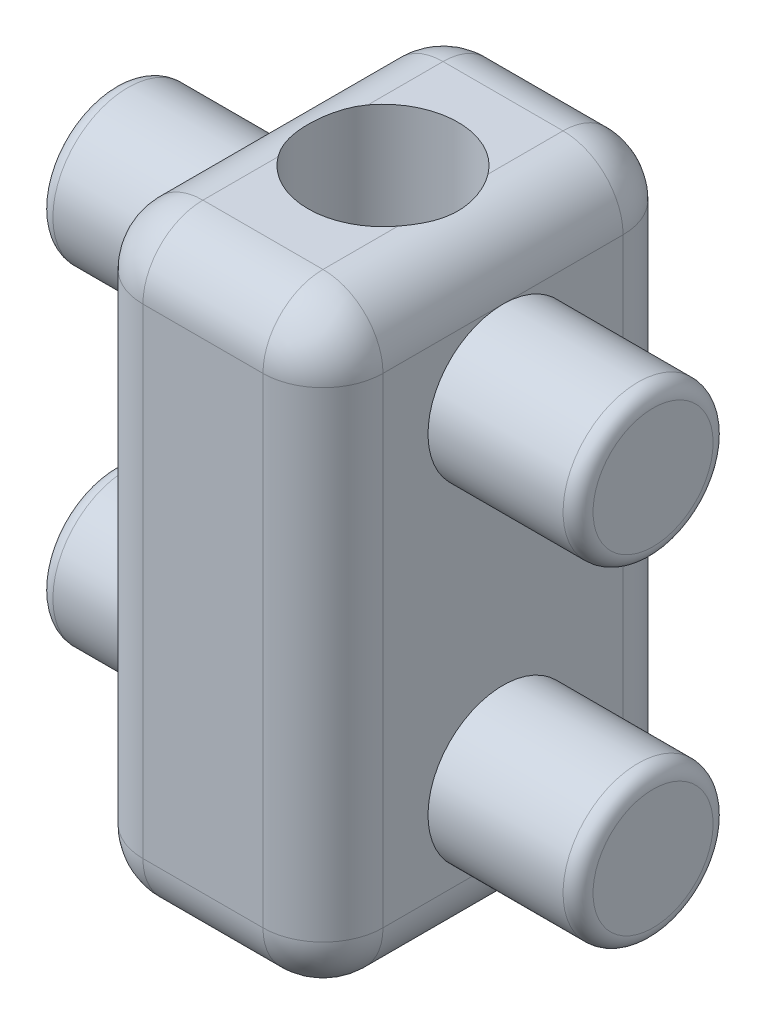
ISO-10303-21;
HEADER;
FILE_DESCRIPTION(('STEP AP214'),'2;1');
FILE_NAME('part.step','',(''),(''),'','','');
FILE_SCHEMA(('AUTOMOTIVE_DESIGN { 1 0 10303 214 1 1 1 1 }'));
ENDSEC;
DATA;
#1=APPLICATION_CONTEXT('core data for automotive mechanical design processes');
#2=APPLICATION_PROTOCOL_DEFINITION('international standard','automotive_design',2000,#1);
#3=PRODUCT_CONTEXT('',#1,'mechanical');
#4=PRODUCT('Part','Part','',(#3));
#5=PRODUCT_RELATED_PRODUCT_CATEGORY('part','',(#4));
#6=PRODUCT_DEFINITION_FORMATION('','',#4);
#7=PRODUCT_DEFINITION_CONTEXT('part definition',#1,'design');
#8=PRODUCT_DEFINITION('design','',#6,#7);
#9=PRODUCT_DEFINITION_SHAPE('','',#8);
#10=(LENGTH_UNIT() NAMED_UNIT(*) SI_UNIT(.MILLI.,.METRE.));
#11=(NAMED_UNIT(*) PLANE_ANGLE_UNIT() SI_UNIT($,.RADIAN.));
#12=(NAMED_UNIT(*) SI_UNIT($,.STERADIAN.) SOLID_ANGLE_UNIT());
#13=UNCERTAINTY_MEASURE_WITH_UNIT(LENGTH_MEASURE(1.E-05),#10,'distance_accuracy_value','');
#14=(GEOMETRIC_REPRESENTATION_CONTEXT(3) GLOBAL_UNCERTAINTY_ASSIGNED_CONTEXT((#13)) GLOBAL_UNIT_ASSIGNED_CONTEXT((#10,
#11,#12)) REPRESENTATION_CONTEXT('',''));
#15=CARTESIAN_POINT('',(0.,0.,0.));
#16=DIRECTION('',(0.,0.,1.));
#17=DIRECTION('',(1.,0.,0.));
#18=AXIS2_PLACEMENT_3D('',#15,#16,#17);
#19=CARTESIAN_POINT('',(-11.43,12.7,-12.7));
#20=DIRECTION('',(0.,-1.,0.));
#21=DIRECTION('',(0.,0.,-1.));
#22=AXIS2_PLACEMENT_3D('',#19,#20,#21);
#23=PLANE('',#22);
#24=DIRECTION('',(0.,0.,1.));
#25=VECTOR('',#24,1.);
#26=CARTESIAN_POINT('',(2.54,12.7,7.62));
#27=LINE('',#26,#25);
#28=CARTESIAN_POINT('',(2.54,12.7,5.08));
#29=VERTEX_POINT('',#28);
#30=CARTESIAN_POINT('',(2.54,12.7,1.905));
#31=VERTEX_POINT('',#30);
#32=EDGE_CURVE('E156',#29,#31,#27,.F.);
#33=ORIENTED_EDGE('',*,*,#32,.T.);
#34=CARTESIAN_POINT('',(0.,12.7,0.));
#35=DIRECTION('',(0.,-1.,0.));
#36=DIRECTION('',(0.,0.,-1.));
#37=AXIS2_PLACEMENT_3D('',#34,#35,#36);
#38=CIRCLE('',#37,3.175);
#39=CARTESIAN_POINT('',(-2.54,12.7,1.905));
#40=VERTEX_POINT('',#39);
#41=EDGE_CURVE('E11',#31,#40,#38,.T.);
#42=ORIENTED_EDGE('',*,*,#41,.T.);
#43=DIRECTION('',(0.,0.,1.));
#44=VECTOR('',#43,1.);
#45=CARTESIAN_POINT('',(-2.54,12.7,7.62));
#46=LINE('',#45,#44);
#47=CARTESIAN_POINT('',(-2.54,12.7,5.08));
#48=VERTEX_POINT('',#47);
#49=EDGE_CURVE('E172',#40,#48,#46,.T.);
#50=ORIENTED_EDGE('',*,*,#49,.T.);
#51=DIRECTION('',(-1.,0.,0.));
#52=VECTOR('',#51,1.);
#53=CARTESIAN_POINT('',(5.08,12.7,5.08));
#54=LINE('',#53,#52);
#55=EDGE_CURVE('E162',#48,#29,#54,.F.);
#56=ORIENTED_EDGE('',*,*,#55,.T.);
#57=EDGE_LOOP('',(#33,#42,#50,#56));
#58=FACE_BOUND('',#57,.T.);
#59=ADVANCED_FACE('F34',(#58),#23,.F.);
#60=CARTESIAN_POINT('',(5.08,0.,0.));
#61=DIRECTION('',(-1.,0.,0.));
#62=DIRECTION('',(0.,0.,1.));
#63=AXIS2_PLACEMENT_3D('',#60,#61,#62);
#64=PLANE('',#63);
#65=DIRECTION('',(0.,0.,-1.));
#66=VECTOR('',#65,1.);
#67=CARTESIAN_POINT('',(5.08,-10.16,0.));
#68=LINE('',#67,#66);
#69=CARTESIAN_POINT('',(5.08,-10.16,5.08));
#70=VERTEX_POINT('',#69);
#71=CARTESIAN_POINT('',(5.08,-10.16,0.));
#72=VERTEX_POINT('',#71);
#73=EDGE_CURVE('E202',#70,#72,#68,.T.);
#74=ORIENTED_EDGE('',*,*,#73,.T.);
#75=CARTESIAN_POINT('',(5.08,-6.985,0.));
#76=DIRECTION('',(1.,0.,0.));
#77=DIRECTION('',(0.,0.,-1.));
#78=AXIS2_PLACEMENT_3D('',#75,#76,#77);
#79=CIRCLE('',#78,3.175);
#80=EDGE_CURVE('E746',#72,#72,#79,.T.);
#81=ORIENTED_EDGE('',*,*,#80,.F.);
#82=CARTESIAN_POINT('',(5.08,-10.16,-5.08));
#83=VERTEX_POINT('',#82);
#84=EDGE_CURVE('E201',#72,#83,#68,.T.);
#85=ORIENTED_EDGE('',*,*,#84,.T.);
#86=DIRECTION('',(0.,1.,0.));
#87=VECTOR('',#86,1.);
#88=CARTESIAN_POINT('',(5.08,0.,-5.08));
#89=LINE('',#88,#87);
#90=CARTESIAN_POINT('',(5.08,10.16,-5.08));
#91=VERTEX_POINT('',#90);
#92=EDGE_CURVE('E195',#83,#91,#89,.T.);
#93=ORIENTED_EDGE('',*,*,#92,.T.);
#94=DIRECTION('',(0.,0.,1.));
#95=VECTOR('',#94,1.);
#96=CARTESIAN_POINT('',(5.08,10.16,0.));
#97=LINE('',#96,#95);
#98=CARTESIAN_POINT('',(5.08,10.16,0.));
#99=VERTEX_POINT('',#98);
#100=EDGE_CURVE('E198',#91,#99,#97,.T.);
#101=ORIENTED_EDGE('',*,*,#100,.T.);
#102=CARTESIAN_POINT('',(5.08,6.985,0.));
#103=DIRECTION('',(1.,0.,0.));
#104=DIRECTION('',(0.,0.,-1.));
#105=AXIS2_PLACEMENT_3D('',#102,#103,#104);
#106=CIRCLE('',#105,3.175);
#107=EDGE_CURVE('E208',#99,#99,#106,.T.);
#108=ORIENTED_EDGE('',*,*,#107,.F.);
#109=CARTESIAN_POINT('',(5.08,10.16,5.08));
#110=VERTEX_POINT('',#109);
#111=EDGE_CURVE('E197',#99,#110,#97,.T.);
#112=ORIENTED_EDGE('',*,*,#111,.T.);
#113=DIRECTION('',(0.,-1.,0.));
#114=VECTOR('',#113,1.);
#115=CARTESIAN_POINT('',(5.08,0.,5.08));
#116=LINE('',#115,#114);
#117=EDGE_CURVE('E57',#110,#70,#116,.T.);
#118=ORIENTED_EDGE('',*,*,#117,.T.);
#119=EDGE_LOOP('',(#74,#81,#85,#93,#101,#108,#112,#118));
#120=FACE_BOUND('',#119,.T.);
#121=ADVANCED_FACE('F364',(#120),#64,.F.);
#122=CARTESIAN_POINT('',(5.08,-12.7,-7.62));
#123=DIRECTION('',(0.,0.,1.));
#124=DIRECTION('',(1.,0.,0.));
#125=AXIS2_PLACEMENT_3D('',#122,#123,#124);
#126=PLANE('',#125);
#127=DIRECTION('',(-1.,0.,0.));
#128=VECTOR('',#127,1.);
#129=CARTESIAN_POINT('',(5.08,-10.16,-7.62));
#130=LINE('',#129,#128);
#131=CARTESIAN_POINT('',(2.54,-10.16,-7.62));
#132=VERTEX_POINT('',#131);
#133=CARTESIAN_POINT('',(-2.54,-10.16,-7.62));
#134=VERTEX_POINT('',#133);
#135=EDGE_CURVE('E756',#132,#134,#130,.T.);
#136=ORIENTED_EDGE('',*,*,#135,.T.);
#137=DIRECTION('',(0.,1.,0.));
#138=VECTOR('',#137,1.);
#139=CARTESIAN_POINT('',(-2.54,12.7,-7.62));
#140=LINE('',#139,#138);
#141=CARTESIAN_POINT('',(-2.54,10.16,-7.62));
#142=VERTEX_POINT('',#141);
#143=EDGE_CURVE('E759',#134,#142,#140,.T.);
#144=ORIENTED_EDGE('',*,*,#143,.T.);
#145=DIRECTION('',(-1.,0.,0.));
#146=VECTOR('',#145,1.);
#147=CARTESIAN_POINT('',(5.08,10.16,-7.62));
#148=LINE('',#147,#146);
#149=CARTESIAN_POINT('',(2.54,10.16,-7.62));
#150=VERTEX_POINT('',#149);
#151=EDGE_CURVE('E754',#142,#150,#148,.F.);
#152=ORIENTED_EDGE('',*,*,#151,.T.);
#153=DIRECTION('',(0.,1.,0.));
#154=VECTOR('',#153,1.);
#155=CARTESIAN_POINT('',(2.54,-12.7,-7.62));
#156=LINE('',#155,#154);
#157=EDGE_CURVE('E275',#150,#132,#156,.F.);
#158=ORIENTED_EDGE('',*,*,#157,.T.);
#159=EDGE_LOOP('',(#136,#144,#152,#158));
#160=FACE_BOUND('',#159,.T.);
#161=ADVANCED_FACE('F367',(#160),#126,.F.);
#162=CARTESIAN_POINT('',(5.08,-12.7,7.62));
#163=DIRECTION('',(0.,0.,-1.));
#164=DIRECTION('',(-1.,0.,0.));
#165=AXIS2_PLACEMENT_3D('',#162,#163,#164);
#166=PLANE('',#165);
#167=DIRECTION('',(-1.,0.,0.));
#168=VECTOR('',#167,1.);
#169=CARTESIAN_POINT('',(5.08,10.16,7.62));
#170=LINE('',#169,#168);
#171=CARTESIAN_POINT('',(2.54,10.16,7.62));
#172=VERTEX_POINT('',#171);
#173=CARTESIAN_POINT('',(-2.54,10.16,7.62));
#174=VERTEX_POINT('',#173);
#175=EDGE_CURVE('E180',#172,#174,#170,.T.);
#176=ORIENTED_EDGE('',*,*,#175,.T.);
#177=DIRECTION('',(0.,-1.,0.));
#178=VECTOR('',#177,1.);
#179=CARTESIAN_POINT('',(-2.54,-12.7,7.62));
#180=LINE('',#179,#178);
#181=CARTESIAN_POINT('',(-2.54,-10.16,7.62));
#182=VERTEX_POINT('',#181);
#183=EDGE_CURVE('E183',#174,#182,#180,.T.);
#184=ORIENTED_EDGE('',*,*,#183,.T.);
#185=DIRECTION('',(-1.,0.,0.));
#186=VECTOR('',#185,1.);
#187=CARTESIAN_POINT('',(5.08,-10.16,7.62));
#188=LINE('',#187,#186);
#189=CARTESIAN_POINT('',(2.54,-10.16,7.62));
#190=VERTEX_POINT('',#189);
#191=EDGE_CURVE('E178',#182,#190,#188,.F.);
#192=ORIENTED_EDGE('',*,*,#191,.T.);
#193=DIRECTION('',(0.,-1.,0.));
#194=VECTOR('',#193,1.);
#195=CARTESIAN_POINT('',(2.54,-12.7,7.62));
#196=LINE('',#195,#194);
#197=EDGE_CURVE('E176',#190,#172,#196,.F.);
#198=ORIENTED_EDGE('',*,*,#197,.T.);
#199=EDGE_LOOP('',(#176,#184,#192,#198));
#200=FACE_BOUND('',#199,.T.);
#201=ADVANCED_FACE('F376',(#200),#166,.F.);
#202=CARTESIAN_POINT('',(5.08,-12.7,7.62));
#203=DIRECTION('',(0.,1.,0.));
#204=DIRECTION('',(0.,0.,1.));
#205=AXIS2_PLACEMENT_3D('',#202,#203,#204);
#206=PLANE('',#205);
#207=DIRECTION('',(-1.,0.,0.));
#208=VECTOR('',#207,1.);
#209=CARTESIAN_POINT('',(5.08,-12.7,5.08));
#210=LINE('',#209,#208);
#211=CARTESIAN_POINT('',(2.54,-12.7,5.08));
#212=VERTEX_POINT('',#211);
#213=CARTESIAN_POINT('',(-2.54,-12.7,5.08));
#214=VERTEX_POINT('',#213);
#215=EDGE_CURVE('E763',#212,#214,#210,.T.);
#216=ORIENTED_EDGE('',*,*,#215,.T.);
#217=DIRECTION('',(0.,0.,-1.));
#218=VECTOR('',#217,1.);
#219=CARTESIAN_POINT('',(-2.54,-12.7,-7.62));
#220=LINE('',#219,#218);
#221=CARTESIAN_POINT('',(-2.54,-12.7,-5.08));
#222=VERTEX_POINT('',#221);
#223=EDGE_CURVE('E167',#214,#222,#220,.T.);
#224=ORIENTED_EDGE('',*,*,#223,.T.);
#225=DIRECTION('',(-1.,0.,0.));
#226=VECTOR('',#225,1.);
#227=CARTESIAN_POINT('',(5.08,-12.7,-5.08));
#228=LINE('',#227,#226);
#229=CARTESIAN_POINT('',(2.54,-12.7,-5.08));
#230=VERTEX_POINT('',#229);
#231=EDGE_CURVE('E764',#222,#230,#228,.F.);
#232=ORIENTED_EDGE('',*,*,#231,.T.);
#233=DIRECTION('',(0.,0.,-1.));
#234=VECTOR('',#233,1.);
#235=CARTESIAN_POINT('',(2.54,-12.7,7.62));
#236=LINE('',#235,#234);
#237=EDGE_CURVE('E761',#230,#212,#236,.F.);
#238=ORIENTED_EDGE('',*,*,#237,.T.);
#239=EDGE_LOOP('',(#216,#224,#232,#238));
#240=FACE_BOUND('',#239,.T.);
#241=ADVANCED_FACE('F372',(#240),#206,.F.);
#242=CARTESIAN_POINT('',(-5.08,0.,0.));
#243=DIRECTION('',(-1.,0.,0.));
#244=DIRECTION('',(0.,0.,1.));
#245=AXIS2_PLACEMENT_3D('',#242,#243,#244);
#246=PLANE('',#245);
#247=DIRECTION('',(0.,0.,-1.));
#248=VECTOR('',#247,1.);
#249=CARTESIAN_POINT('',(-5.08,-10.16,7.62));
#250=LINE('',#249,#248);
#251=CARTESIAN_POINT('',(-5.08,-10.16,-5.08));
#252=VERTEX_POINT('',#251);
#253=CARTESIAN_POINT('',(-5.08,-10.16,0.));
#254=VERTEX_POINT('',#253);
#255=EDGE_CURVE('E188',#252,#254,#250,.F.);
#256=ORIENTED_EDGE('',*,*,#255,.T.);
#257=CARTESIAN_POINT('',(-5.08,-6.985,0.));
#258=DIRECTION('',(1.,0.,0.));
#259=DIRECTION('',(0.,0.,-1.));
#260=AXIS2_PLACEMENT_3D('',#257,#258,#259);
#261=CIRCLE('',#260,3.175);
#262=EDGE_CURVE('E159',#254,#254,#261,.T.);
#263=ORIENTED_EDGE('',*,*,#262,.T.);
#264=CARTESIAN_POINT('',(-5.08,-10.16,5.08));
#265=VERTEX_POINT('',#264);
#266=EDGE_CURVE('E187',#254,#265,#250,.F.);
#267=ORIENTED_EDGE('',*,*,#266,.T.);
#268=DIRECTION('',(0.,-1.,0.));
#269=VECTOR('',#268,1.);
#270=CARTESIAN_POINT('',(-5.08,12.7,5.08));
#271=LINE('',#270,#269);
#272=CARTESIAN_POINT('',(-5.08,10.16,5.08));
#273=VERTEX_POINT('',#272);
#274=EDGE_CURVE('E190',#265,#273,#271,.F.);
#275=ORIENTED_EDGE('',*,*,#274,.T.);
#276=DIRECTION('',(0.,0.,1.));
#277=VECTOR('',#276,1.);
#278=CARTESIAN_POINT('',(-5.08,10.16,-7.62));
#279=LINE('',#278,#277);
#280=CARTESIAN_POINT('',(-5.08,10.16,0.));
#281=VERTEX_POINT('',#280);
#282=EDGE_CURVE('E193',#273,#281,#279,.F.);
#283=ORIENTED_EDGE('',*,*,#282,.T.);
#284=CARTESIAN_POINT('',(-5.08,6.985,0.));
#285=DIRECTION('',(1.,0.,0.));
#286=DIRECTION('',(0.,0.,-1.));
#287=AXIS2_PLACEMENT_3D('',#284,#285,#286);
#288=CIRCLE('',#287,3.175);
#289=EDGE_CURVE('E744',#281,#281,#288,.T.);
#290=ORIENTED_EDGE('',*,*,#289,.T.);
#291=CARTESIAN_POINT('',(-5.08,10.16,-5.08));
#292=VERTEX_POINT('',#291);
#293=EDGE_CURVE('E192',#281,#292,#279,.F.);
#294=ORIENTED_EDGE('',*,*,#293,.T.);
#295=DIRECTION('',(0.,1.,0.));
#296=VECTOR('',#295,1.);
#297=CARTESIAN_POINT('',(-5.08,-12.7,-5.08));
#298=LINE('',#297,#296);
#299=EDGE_CURVE('E185',#292,#252,#298,.F.);
#300=ORIENTED_EDGE('',*,*,#299,.T.);
#301=EDGE_LOOP('',(#256,#263,#267,#275,#283,#290,#294,#300));
#302=FACE_BOUND('',#301,.T.);
#303=ADVANCED_FACE('F368',(#302),#246,.T.);
#304=CARTESIAN_POINT('',(5.08,10.16,5.08));
#305=DIRECTION('',(-1.,0.,0.));
#306=DIRECTION('',(0.,0.,1.));
#307=AXIS2_PLACEMENT_3D('',#304,#305,#306);
#308=CYLINDRICAL_SURFACE('',#307,2.54);
#309=CARTESIAN_POINT('',(2.54,10.16,5.08));
#310=DIRECTION('',(1.,0.,0.));
#311=DIRECTION('',(0.,0.,-1.));
#312=AXIS2_PLACEMENT_3D('',#309,#310,#311);
#313=CIRCLE('',#312,2.54);
#314=EDGE_CURVE('E272',#29,#172,#313,.T.);
#315=ORIENTED_EDGE('',*,*,#314,.F.);
#316=ORIENTED_EDGE('',*,*,#55,.F.);
#317=CARTESIAN_POINT('',(-2.54,10.16,5.08));
#318=DIRECTION('',(-1.,0.,0.));
#319=DIRECTION('',(0.,0.,1.));
#320=AXIS2_PLACEMENT_3D('',#317,#318,#319);
#321=CIRCLE('',#320,2.54);
#322=EDGE_CURVE('E269',#174,#48,#321,.T.);
#323=ORIENTED_EDGE('',*,*,#322,.F.);
#324=ORIENTED_EDGE('',*,*,#175,.F.);
#325=EDGE_LOOP('',(#315,#316,#323,#324));
#326=FACE_BOUND('',#325,.T.);
#327=ADVANCED_FACE('F371',(#326),#308,.T.);
#328=CARTESIAN_POINT('',(2.54,10.16,5.08));
#329=DIRECTION('',(0.,0.,1.));
#330=DIRECTION('',(1.,0.,0.));
#331=AXIS2_PLACEMENT_3D('',#328,#329,#330);
#332=SPHERICAL_SURFACE('',#331,2.54);
#333=CARTESIAN_POINT('',(2.54,10.16,5.08));
#334=DIRECTION('',(0.,0.,1.));
#335=DIRECTION('',(1.,0.,0.));
#336=AXIS2_PLACEMENT_3D('',#333,#334,#335);
#337=CIRCLE('',#336,2.54);
#338=EDGE_CURVE('E264',#29,#110,#337,.F.);
#339=ORIENTED_EDGE('',*,*,#338,.F.);
#340=ORIENTED_EDGE('',*,*,#314,.T.);
#341=CARTESIAN_POINT('',(2.54,10.16,5.08));
#342=DIRECTION('',(0.,1.,0.));
#343=DIRECTION('',(0.,0.,1.));
#344=AXIS2_PLACEMENT_3D('',#341,#342,#343);
#345=CIRCLE('',#344,2.54);
#346=EDGE_CURVE('E266',#110,#172,#345,.F.);
#347=ORIENTED_EDGE('',*,*,#346,.F.);
#348=EDGE_LOOP('',(#339,#340,#347));
#349=FACE_BOUND('',#348,.T.);
#350=ADVANCED_FACE('F468',(#349),#332,.T.);
#351=CARTESIAN_POINT('',(-2.54,10.16,5.08));
#352=DIRECTION('',(0.,0.,1.));
#353=DIRECTION('',(1.,0.,0.));
#354=AXIS2_PLACEMENT_3D('',#351,#352,#353);
#355=SPHERICAL_SURFACE('',#354,2.54);
#356=CARTESIAN_POINT('',(-2.54,10.16,5.08));
#357=DIRECTION('',(0.,1.,0.));
#358=DIRECTION('',(0.,0.,1.));
#359=AXIS2_PLACEMENT_3D('',#356,#357,#358);
#360=CIRCLE('',#359,2.54);
#361=EDGE_CURVE('E258',#174,#273,#360,.F.);
#362=ORIENTED_EDGE('',*,*,#361,.F.);
#363=ORIENTED_EDGE('',*,*,#322,.T.);
#364=CARTESIAN_POINT('',(-2.54,10.16,5.08));
#365=DIRECTION('',(0.,0.,1.));
#366=DIRECTION('',(1.,0.,0.));
#367=AXIS2_PLACEMENT_3D('',#364,#365,#366);
#368=CIRCLE('',#367,2.54);
#369=EDGE_CURVE('E261',#273,#48,#368,.F.);
#370=ORIENTED_EDGE('',*,*,#369,.F.);
#371=EDGE_LOOP('',(#362,#363,#370));
#372=FACE_BOUND('',#371,.T.);
#373=ADVANCED_FACE('F477',(#372),#355,.T.);
#374=CARTESIAN_POINT('',(2.54,0.,5.08));
#375=DIRECTION('',(0.,-1.,0.));
#376=DIRECTION('',(0.,0.,-1.));
#377=AXIS2_PLACEMENT_3D('',#374,#375,#376);
#378=CYLINDRICAL_SURFACE('',#377,2.54);
#379=ORIENTED_EDGE('',*,*,#346,.T.);
#380=ORIENTED_EDGE('',*,*,#197,.F.);
#381=CARTESIAN_POINT('',(2.54,-10.16,5.08));
#382=DIRECTION('',(0.,-1.,0.));
#383=DIRECTION('',(0.,0.,-1.));
#384=AXIS2_PLACEMENT_3D('',#381,#382,#383);
#385=CIRCLE('',#384,2.54);
#386=EDGE_CURVE('E252',#70,#190,#385,.T.);
#387=ORIENTED_EDGE('',*,*,#386,.F.);
#388=ORIENTED_EDGE('',*,*,#117,.F.);
#389=EDGE_LOOP('',(#379,#380,#387,#388));
#390=FACE_BOUND('',#389,.T.);
#391=ADVANCED_FACE('F485',(#390),#378,.T.);
#392=CARTESIAN_POINT('',(2.54,10.16,0.));
#393=DIRECTION('',(0.,0.,1.));
#394=DIRECTION('',(1.,0.,0.));
#395=AXIS2_PLACEMENT_3D('',#392,#393,#394);
#396=CYLINDRICAL_SURFACE('',#395,2.54);
#397=CARTESIAN_POINT('',(2.54,12.7,1.905));
#398=CARTESIAN_POINT('',(2.5930144747761,12.6999862252163,1.83433008024039));
#399=CARTESIAN_POINT('',(2.64304418780027,12.6983400949674,1.76146316158012));
#400=CARTESIAN_POINT('',(2.73681256754995,12.6928023717573,1.61190923242004));
#401=CARTESIAN_POINT('',(2.78055403974719,12.6889117840593,1.5352239461572));
#402=CARTESIAN_POINT('',(2.86150406932594,12.6798990340502,1.37848165114559));
#403=CARTESIAN_POINT('',(2.89870748689939,12.6747759102249,1.29842205047689));
#404=CARTESIAN_POINT('',(2.96631988606513,12.6642012790137,1.13549535037719));
#405=CARTESIAN_POINT('',(2.99672819686997,12.6587497392752,1.05262797470223));
#406=CARTESIAN_POINT('',(3.05054069604224,12.6483126113036,0.88464818978456));
#407=CARTESIAN_POINT('',(3.0739470624711,12.6433268785069,0.799536487656744));
#408=CARTESIAN_POINT('',(3.1136022125579,12.6344684587865,0.627605400580466));
#409=CARTESIAN_POINT('',(3.12985126443965,12.6305957301544,0.540786079753235));
#410=CARTESIAN_POINT('',(3.15504934782979,12.624443734051,0.366145178129403));
#411=CARTESIAN_POINT('',(3.16400731259552,12.6221625171033,0.278324957914515));
#412=CARTESIAN_POINT('',(3.17458002225839,12.6194589557401,0.102214919682188));
#413=CARTESIAN_POINT('',(3.17619487430703,12.6190365842002,0.0139251085358922));
#414=CARTESIAN_POINT('',(3.17208089299991,12.6200971385345,-0.161895069374409));
#415=CARTESIAN_POINT('',(3.16639983447211,12.6215676695157,-0.249426636477158));
#416=CARTESIAN_POINT('',(3.14782483185976,12.6262198130967,-0.423675780026822));
#417=CARTESIAN_POINT('',(3.13493069870951,12.6294014705478,-0.510393335076655));
#418=CARTESIAN_POINT('',(3.10201816982114,12.6370992435227,-0.682489232509958));
#419=CARTESIAN_POINT('',(3.08199288994507,12.6416166478083,-0.767866197293173));
#420=CARTESIAN_POINT('',(3.03496640143451,12.6514222048976,-0.936630510721468));
#421=CARTESIAN_POINT('',(3.00796532716197,12.6567103428551,-1.02001789765435));
#422=CARTESIAN_POINT('',(2.95102683913863,12.6666673723006,-1.17384523842122));
#423=CARTESIAN_POINT('',(2.92189644299456,12.6713297189628,-1.24458573482167));
#424=CARTESIAN_POINT('',(2.85859769024736,12.68014203093,-1.3837954353501));
#425=CARTESIAN_POINT('',(2.82443031366766,12.6842920956194,-1.45226507814085));
#426=CARTESIAN_POINT('',(2.75126299343156,12.6914658240478,-1.58650838612093));
#427=CARTESIAN_POINT('',(2.71227019344552,12.6944911269402,-1.65228584922509));
#428=CARTESIAN_POINT('',(2.62959767281221,12.6987548964392,-1.78092659831066));
#429=CARTESIAN_POINT('',(2.5859157945231,12.6999925366479,-1.84378852351398));
#430=CARTESIAN_POINT('',(2.54,12.7,-1.905));
#431=B_SPLINE_CURVE_WITH_KNOTS('',3,(#397,#398,#399,#400,#401,#402,#403,#404,#405,#406,#407,
#408,#409,#410,#411,#412,#413,#414,#415,#416,#417,#418,#419,#420,#421,#422,#423,#424,#425,#426,
#427,#428,#429,#430),.UNSPECIFIED.,.F.,.F.,(4,2,2,2,2,2,2,2,2,2,2,2,2,2,2,2,4),(0.,
0.26489527949035,0.529672007856606,0.794655964885841,1.05966606859315,1.32459365094662,
1.58951130416678,1.85410388168812,2.1186925982337,2.38155754601834,2.64442938421755,
2.90755567990787,3.17067690785609,3.40041930587477,3.63011706276295,3.85947874883193,
4.08894642994839),.UNSPECIFIED.);
#432=CARTESIAN_POINT('',(2.54,12.7,-1.905));
#433=VERTEX_POINT('',#432);
#434=EDGE_CURVE('E49',#31,#433,#431,.T.);
#435=ORIENTED_EDGE('',*,*,#434,.F.);
#436=ORIENTED_EDGE('',*,*,#32,.F.);
#437=ORIENTED_EDGE('',*,*,#338,.T.);
#438=ORIENTED_EDGE('',*,*,#111,.F.);
#439=ORIENTED_EDGE('',*,*,#100,.F.);
#440=CARTESIAN_POINT('',(2.54,10.16,-5.08));
#441=DIRECTION('',(0.,0.,-1.));
#442=DIRECTION('',(-1.,0.,0.));
#443=AXIS2_PLACEMENT_3D('',#440,#441,#442);
#444=CIRCLE('',#443,2.54);
#445=CARTESIAN_POINT('',(2.54,12.7,-5.08));
#446=VERTEX_POINT('',#445);
#447=EDGE_CURVE('E249',#446,#91,#444,.T.);
#448=ORIENTED_EDGE('',*,*,#447,.F.);
#449=EDGE_CURVE('E158',#433,#446,#27,.F.);
#450=ORIENTED_EDGE('',*,*,#449,.F.);
#451=EDGE_LOOP('',(#435,#436,#437,#438,#439,#448,#450));
#452=FACE_BOUND('',#451,.T.);
#453=ADVANCED_FACE('F154',(#452),#396,.T.);
#454=CARTESIAN_POINT('',(5.08,10.16,-5.08));
#455=DIRECTION('',(-1.,0.,0.));
#456=DIRECTION('',(0.,0.,1.));
#457=AXIS2_PLACEMENT_3D('',#454,#455,#456);
#458=CYLINDRICAL_SURFACE('',#457,2.54);
#459=CARTESIAN_POINT('',(-2.54,10.16,-5.08));
#460=DIRECTION('',(-1.,0.,0.));
#461=DIRECTION('',(0.,0.,1.));
#462=AXIS2_PLACEMENT_3D('',#459,#460,#461);
#463=CIRCLE('',#462,2.54);
#464=CARTESIAN_POINT('',(-2.54,12.7,-5.08));
#465=VERTEX_POINT('',#464);
#466=EDGE_CURVE('E243',#465,#142,#463,.T.);
#467=ORIENTED_EDGE('',*,*,#466,.F.);
#468=DIRECTION('',(-1.,0.,0.));
#469=VECTOR('',#468,1.);
#470=CARTESIAN_POINT('',(5.08,12.7,-5.08));
#471=LINE('',#470,#469);
#472=EDGE_CURVE('E165',#446,#465,#471,.T.);
#473=ORIENTED_EDGE('',*,*,#472,.F.);
#474=CARTESIAN_POINT('',(2.54,10.16,-5.08));
#475=DIRECTION('',(1.,0.,0.));
#476=DIRECTION('',(0.,0.,-1.));
#477=AXIS2_PLACEMENT_3D('',#474,#475,#476);
#478=CIRCLE('',#477,2.54);
#479=EDGE_CURVE('E246',#150,#446,#478,.T.);
#480=ORIENTED_EDGE('',*,*,#479,.F.);
#481=ORIENTED_EDGE('',*,*,#151,.F.);
#482=EDGE_LOOP('',(#467,#473,#480,#481));
#483=FACE_BOUND('',#482,.T.);
#484=ADVANCED_FACE('F436',(#483),#458,.T.);
#485=CARTESIAN_POINT('',(-2.54,10.16,7.62));
#486=DIRECTION('',(0.,0.,-1.));
#487=DIRECTION('',(-1.,0.,0.));
#488=AXIS2_PLACEMENT_3D('',#485,#486,#487);
#489=CYLINDRICAL_SURFACE('',#488,2.54);
#490=CARTESIAN_POINT('',(-2.54,12.7,-1.905));
#491=CARTESIAN_POINT('',(-2.5930144747761,12.6999862252163,-1.83433008024039));
#492=CARTESIAN_POINT('',(-2.64304418780027,12.6983400949674,-1.76146316158012));
#493=CARTESIAN_POINT('',(-2.73681256754995,12.6928023717573,-1.61190923242004));
#494=CARTESIAN_POINT('',(-2.78055403974719,12.6889117840593,-1.53522394615721));
#495=CARTESIAN_POINT('',(-2.86150406932594,12.6798990340502,-1.37848165114559));
#496=CARTESIAN_POINT('',(-2.89870748689939,12.6747759102249,-1.29842205047689));
#497=CARTESIAN_POINT('',(-2.96631988606513,12.6642012790137,-1.13549535037719));
#498=CARTESIAN_POINT('',(-2.99672819686997,12.6587497392752,-1.05262797470223));
#499=CARTESIAN_POINT('',(-3.05054069604224,12.6483126113036,-0.884648189784562));
#500=CARTESIAN_POINT('',(-3.0739470624711,12.6433268785069,-0.799536487656746));
#501=CARTESIAN_POINT('',(-3.1136022125579,12.6344684587865,-0.627605400580467));
#502=CARTESIAN_POINT('',(-3.12985126443965,12.6305957301544,-0.540786079753237));
#503=CARTESIAN_POINT('',(-3.15504934782979,12.624443734051,-0.366145178129405));
#504=CARTESIAN_POINT('',(-3.16400731259552,12.6221625171033,-0.278324957914517));
#505=CARTESIAN_POINT('',(-3.17458002225839,12.6194589557401,-0.10221491968219));
#506=CARTESIAN_POINT('',(-3.17619487430703,12.6190365842002,-0.0139251085358941));
#507=CARTESIAN_POINT('',(-3.17208089299991,12.6200971385345,0.161895069374407));
#508=CARTESIAN_POINT('',(-3.16639983447211,12.6215676695157,0.249426636477156));
#509=CARTESIAN_POINT('',(-3.14782483185976,12.6262198130967,0.42367578002682));
#510=CARTESIAN_POINT('',(-3.13493069870951,12.6294014705478,0.510393335076653));
#511=CARTESIAN_POINT('',(-3.10201816982114,12.6370992435227,0.682489232509956));
#512=CARTESIAN_POINT('',(-3.08199288994507,12.6416166478083,0.767866197293171));
#513=CARTESIAN_POINT('',(-3.03496640143451,12.6514222048976,0.936630510721466));
#514=CARTESIAN_POINT('',(-3.00796532716197,12.6567103428551,1.02001789765435));
#515=CARTESIAN_POINT('',(-2.95102683913863,12.6666673723006,1.17384523842122));
#516=CARTESIAN_POINT('',(-2.92189644299456,12.6713297189628,1.24458573482167));
#517=CARTESIAN_POINT('',(-2.85859769024736,12.68014203093,1.3837954353501));
#518=CARTESIAN_POINT('',(-2.82443031366766,12.6842920956194,1.45226507814085));
#519=CARTESIAN_POINT('',(-2.75126299343156,12.6914658240478,1.58650838612093));
#520=CARTESIAN_POINT('',(-2.71227019344552,12.6944911269402,1.65228584922509));
#521=CARTESIAN_POINT('',(-2.62959767281221,12.6987548964392,1.78092659831066));
#522=CARTESIAN_POINT('',(-2.5859157945231,12.6999925366479,1.84378852351398));
#523=CARTESIAN_POINT('',(-2.54,12.7,1.905));
#524=B_SPLINE_CURVE_WITH_KNOTS('',3,(#490,#491,#492,#493,#494,#495,#496,#497,#498,#499,#500,
#501,#502,#503,#504,#505,#506,#507,#508,#509,#510,#511,#512,#513,#514,#515,#516,#517,#518,#519,
#520,#521,#522,#523),.UNSPECIFIED.,.F.,.F.,(4,2,2,2,2,2,2,2,2,2,2,2,2,2,2,2,4),(0.,
0.26489527949035,0.529672007856606,0.794655964885841,1.05966606859315,1.32459365094662,
1.58951130416678,1.85410388168812,2.1186925982337,2.38155754601833,2.64442938421755,
2.90755567990787,3.17067690785609,3.40041930587477,3.63011706276295,3.85947874883193,
4.08894642994839),.UNSPECIFIED.);
#525=CARTESIAN_POINT('',(-2.54,12.7,-1.905));
#526=VERTEX_POINT('',#525);
#527=EDGE_CURVE('E147',#526,#40,#524,.T.);
#528=ORIENTED_EDGE('',*,*,#527,.F.);
#529=EDGE_CURVE('E173',#465,#526,#46,.T.);
#530=ORIENTED_EDGE('',*,*,#529,.F.);
#531=CARTESIAN_POINT('',(-2.54,10.16,-5.08));
#532=DIRECTION('',(0.,0.,-1.));
#533=DIRECTION('',(0.,1.,0.));
#534=AXIS2_PLACEMENT_3D('',#531,#532,#533);
#535=CIRCLE('',#534,2.54);
#536=EDGE_CURVE('E240',#292,#465,#535,.T.);
#537=ORIENTED_EDGE('',*,*,#536,.F.);
#538=ORIENTED_EDGE('',*,*,#293,.F.);
#539=ORIENTED_EDGE('',*,*,#282,.F.);
#540=ORIENTED_EDGE('',*,*,#369,.T.);
#541=ORIENTED_EDGE('',*,*,#49,.F.);
#542=EDGE_LOOP('',(#528,#530,#537,#538,#539,#540,#541));
#543=FACE_BOUND('',#542,.T.);
#544=ADVANCED_FACE('F304',(#543),#489,.T.);
#545=CARTESIAN_POINT('',(-2.54,-12.7,5.08));
#546=DIRECTION('',(0.,1.,0.));
#547=DIRECTION('',(0.,0.,1.));
#548=AXIS2_PLACEMENT_3D('',#545,#546,#547);
#549=CYLINDRICAL_SURFACE('',#548,2.54);
#550=ORIENTED_EDGE('',*,*,#361,.T.);
#551=ORIENTED_EDGE('',*,*,#274,.F.);
#552=CARTESIAN_POINT('',(-2.54,-10.16,5.08));
#553=DIRECTION('',(0.,-1.,0.));
#554=DIRECTION('',(0.,0.,-1.));
#555=AXIS2_PLACEMENT_3D('',#552,#553,#554);
#556=CIRCLE('',#555,2.54);
#557=EDGE_CURVE('E237',#182,#265,#556,.T.);
#558=ORIENTED_EDGE('',*,*,#557,.F.);
#559=ORIENTED_EDGE('',*,*,#183,.F.);
#560=EDGE_LOOP('',(#550,#551,#558,#559));
#561=FACE_BOUND('',#560,.T.);
#562=ADVANCED_FACE('F429',(#561),#549,.T.);
#563=CARTESIAN_POINT('',(5.08,-10.16,5.08));
#564=DIRECTION('',(-1.,0.,0.));
#565=DIRECTION('',(0.,0.,1.));
#566=AXIS2_PLACEMENT_3D('',#563,#564,#565);
#567=CYLINDRICAL_SURFACE('',#566,2.54);
#568=CARTESIAN_POINT('',(2.54,-10.16,5.08));
#569=DIRECTION('',(1.,0.,0.));
#570=DIRECTION('',(0.,0.,-1.));
#571=AXIS2_PLACEMENT_3D('',#568,#569,#570);
#572=CIRCLE('',#571,2.54);
#573=EDGE_CURVE('E255',#190,#212,#572,.T.);
#574=ORIENTED_EDGE('',*,*,#573,.F.);
#575=ORIENTED_EDGE('',*,*,#191,.F.);
#576=CARTESIAN_POINT('',(-2.54,-10.16,5.08));
#577=DIRECTION('',(-1.,0.,0.));
#578=DIRECTION('',(0.,0.,1.));
#579=AXIS2_PLACEMENT_3D('',#576,#577,#578);
#580=CIRCLE('',#579,2.54);
#581=EDGE_CURVE('E234',#214,#182,#580,.T.);
#582=ORIENTED_EDGE('',*,*,#581,.F.);
#583=ORIENTED_EDGE('',*,*,#215,.F.);
#584=EDGE_LOOP('',(#574,#575,#582,#583));
#585=FACE_BOUND('',#584,.T.);
#586=ADVANCED_FACE('F426',(#585),#567,.T.);
#587=CARTESIAN_POINT('',(2.54,-10.16,5.08));
#588=DIRECTION('',(0.,0.,1.));
#589=DIRECTION('',(1.,0.,0.));
#590=AXIS2_PLACEMENT_3D('',#587,#588,#589);
#591=SPHERICAL_SURFACE('',#590,2.54);
#592=ORIENTED_EDGE('',*,*,#386,.T.);
#593=ORIENTED_EDGE('',*,*,#573,.T.);
#594=CARTESIAN_POINT('',(2.54,-10.16,5.08));
#595=DIRECTION('',(0.,0.,1.));
#596=DIRECTION('',(1.,0.,0.));
#597=AXIS2_PLACEMENT_3D('',#594,#595,#596);
#598=CIRCLE('',#597,2.54);
#599=EDGE_CURVE('E231',#70,#212,#598,.F.);
#600=ORIENTED_EDGE('',*,*,#599,.F.);
#601=EDGE_LOOP('',(#592,#593,#600));
#602=FACE_BOUND('',#601,.T.);
#603=ADVANCED_FACE('F422',(#602),#591,.T.);
#604=CARTESIAN_POINT('',(2.54,10.16,-5.08));
#605=DIRECTION('',(0.,0.,1.));
#606=DIRECTION('',(1.,0.,0.));
#607=AXIS2_PLACEMENT_3D('',#604,#605,#606);
#608=SPHERICAL_SURFACE('',#607,2.54);
#609=ORIENTED_EDGE('',*,*,#479,.T.);
#610=ORIENTED_EDGE('',*,*,#447,.T.);
#611=CARTESIAN_POINT('',(2.54,10.16,-5.08));
#612=DIRECTION('',(0.,1.,0.));
#613=DIRECTION('',(0.,0.,1.));
#614=AXIS2_PLACEMENT_3D('',#611,#612,#613);
#615=CIRCLE('',#614,2.54);
#616=EDGE_CURVE('E228',#150,#91,#615,.F.);
#617=ORIENTED_EDGE('',*,*,#616,.F.);
#618=EDGE_LOOP('',(#609,#610,#617));
#619=FACE_BOUND('',#618,.T.);
#620=ADVANCED_FACE('F418',(#619),#608,.T.);
#621=CARTESIAN_POINT('',(-2.54,10.16,-5.08));
#622=DIRECTION('',(0.,0.,1.));
#623=DIRECTION('',(1.,0.,0.));
#624=AXIS2_PLACEMENT_3D('',#621,#622,#623);
#625=SPHERICAL_SURFACE('',#624,2.54);
#626=ORIENTED_EDGE('',*,*,#536,.T.);
#627=ORIENTED_EDGE('',*,*,#466,.T.);
#628=CARTESIAN_POINT('',(-2.54,10.16,-5.08));
#629=DIRECTION('',(0.,1.,0.));
#630=DIRECTION('',(0.,0.,1.));
#631=AXIS2_PLACEMENT_3D('',#628,#629,#630);
#632=CIRCLE('',#631,2.54);
#633=EDGE_CURVE('E225',#292,#142,#632,.F.);
#634=ORIENTED_EDGE('',*,*,#633,.F.);
#635=EDGE_LOOP('',(#626,#627,#634));
#636=FACE_BOUND('',#635,.T.);
#637=ADVANCED_FACE('F414',(#636),#625,.T.);
#638=CARTESIAN_POINT('',(-2.54,-10.16,5.08));
#639=DIRECTION('',(0.,0.,1.));
#640=DIRECTION('',(1.,0.,0.));
#641=AXIS2_PLACEMENT_3D('',#638,#639,#640);
#642=SPHERICAL_SURFACE('',#641,2.54);
#643=ORIENTED_EDGE('',*,*,#581,.T.);
#644=ORIENTED_EDGE('',*,*,#557,.T.);
#645=CARTESIAN_POINT('',(-2.54,-10.16,5.08));
#646=DIRECTION('',(0.,0.,1.));
#647=DIRECTION('',(1.,0.,0.));
#648=AXIS2_PLACEMENT_3D('',#645,#646,#647);
#649=CIRCLE('',#648,2.54);
#650=EDGE_CURVE('E222',#214,#265,#649,.F.);
#651=ORIENTED_EDGE('',*,*,#650,.F.);
#652=EDGE_LOOP('',(#643,#644,#651));
#653=FACE_BOUND('',#652,.T.);
#654=ADVANCED_FACE('F410',(#653),#642,.T.);
#655=CARTESIAN_POINT('',(2.54,-10.16,0.));
#656=DIRECTION('',(0.,0.,-1.));
#657=DIRECTION('',(-1.,0.,0.));
#658=AXIS2_PLACEMENT_3D('',#655,#656,#657);
#659=CYLINDRICAL_SURFACE('',#658,2.54);
#660=ORIENTED_EDGE('',*,*,#599,.T.);
#661=ORIENTED_EDGE('',*,*,#237,.F.);
#662=CARTESIAN_POINT('',(2.54,-10.16,-5.08));
#663=DIRECTION('',(0.,0.,-1.));
#664=DIRECTION('',(-1.,0.,0.));
#665=AXIS2_PLACEMENT_3D('',#662,#663,#664);
#666=CIRCLE('',#665,2.54);
#667=EDGE_CURVE('E219',#83,#230,#666,.T.);
#668=ORIENTED_EDGE('',*,*,#667,.F.);
#669=ORIENTED_EDGE('',*,*,#84,.F.);
#670=ORIENTED_EDGE('',*,*,#73,.F.);
#671=EDGE_LOOP('',(#660,#661,#668,#669,#670));
#672=FACE_BOUND('',#671,.T.);
#673=ADVANCED_FACE('F406',(#672),#659,.T.);
#674=CARTESIAN_POINT('',(2.54,0.,-5.08));
#675=DIRECTION('',(0.,1.,0.));
#676=DIRECTION('',(0.,0.,1.));
#677=AXIS2_PLACEMENT_3D('',#674,#675,#676);
#678=CYLINDRICAL_SURFACE('',#677,2.54);
#679=ORIENTED_EDGE('',*,*,#616,.T.);
#680=ORIENTED_EDGE('',*,*,#92,.F.);
#681=CARTESIAN_POINT('',(2.54,-10.16,-5.08));
#682=DIRECTION('',(0.,-1.,0.));
#683=DIRECTION('',(0.,0.,-1.));
#684=AXIS2_PLACEMENT_3D('',#681,#682,#683);
#685=CIRCLE('',#684,2.54);
#686=EDGE_CURVE('E216',#132,#83,#685,.T.);
#687=ORIENTED_EDGE('',*,*,#686,.F.);
#688=ORIENTED_EDGE('',*,*,#157,.F.);
#689=EDGE_LOOP('',(#679,#680,#687,#688));
#690=FACE_BOUND('',#689,.T.);
#691=ADVANCED_FACE('F402',(#690),#678,.T.);
#692=CARTESIAN_POINT('',(-2.54,-12.7,-5.08));
#693=DIRECTION('',(0.,-1.,0.));
#694=DIRECTION('',(0.,0.,-1.));
#695=AXIS2_PLACEMENT_3D('',#692,#693,#694);
#696=CYLINDRICAL_SURFACE('',#695,2.54);
#697=ORIENTED_EDGE('',*,*,#633,.T.);
#698=ORIENTED_EDGE('',*,*,#143,.F.);
#699=CARTESIAN_POINT('',(-2.54,-10.16,-5.08));
#700=DIRECTION('',(0.,-1.,0.));
#701=DIRECTION('',(0.,0.,-1.));
#702=AXIS2_PLACEMENT_3D('',#699,#700,#701);
#703=CIRCLE('',#702,2.54);
#704=EDGE_CURVE('E213',#252,#134,#703,.T.);
#705=ORIENTED_EDGE('',*,*,#704,.F.);
#706=ORIENTED_EDGE('',*,*,#299,.F.);
#707=EDGE_LOOP('',(#697,#698,#705,#706));
#708=FACE_BOUND('',#707,.T.);
#709=ADVANCED_FACE('F398',(#708),#696,.T.);
#710=CARTESIAN_POINT('',(-2.54,-10.16,7.62));
#711=DIRECTION('',(0.,0.,1.));
#712=DIRECTION('',(1.,0.,0.));
#713=AXIS2_PLACEMENT_3D('',#710,#711,#712);
#714=CYLINDRICAL_SURFACE('',#713,2.54);
#715=ORIENTED_EDGE('',*,*,#650,.T.);
#716=ORIENTED_EDGE('',*,*,#266,.F.);
#717=ORIENTED_EDGE('',*,*,#255,.F.);
#718=CARTESIAN_POINT('',(-2.54,-10.16,-5.08));
#719=DIRECTION('',(0.,0.,-1.));
#720=DIRECTION('',(-1.,0.,0.));
#721=AXIS2_PLACEMENT_3D('',#718,#719,#720);
#722=CIRCLE('',#721,2.54);
#723=EDGE_CURVE('E210',#222,#252,#722,.T.);
#724=ORIENTED_EDGE('',*,*,#723,.F.);
#725=ORIENTED_EDGE('',*,*,#223,.F.);
#726=EDGE_LOOP('',(#715,#716,#717,#724,#725));
#727=FACE_BOUND('',#726,.T.);
#728=ADVANCED_FACE('F394',(#727),#714,.T.);
#729=CARTESIAN_POINT('',(2.54,-10.16,-5.08));
#730=DIRECTION('',(0.,0.,1.));
#731=DIRECTION('',(1.,0.,0.));
#732=AXIS2_PLACEMENT_3D('',#729,#730,#731);
#733=SPHERICAL_SURFACE('',#732,2.54);
#734=ORIENTED_EDGE('',*,*,#686,.T.);
#735=ORIENTED_EDGE('',*,*,#667,.T.);
#736=CARTESIAN_POINT('',(2.54,-10.16,-5.08));
#737=DIRECTION('',(1.,0.,0.));
#738=DIRECTION('',(0.,0.,-1.));
#739=AXIS2_PLACEMENT_3D('',#736,#737,#738);
#740=CIRCLE('',#739,2.54);
#741=EDGE_CURVE('E207',#132,#230,#740,.F.);
#742=ORIENTED_EDGE('',*,*,#741,.F.);
#743=EDGE_LOOP('',(#734,#735,#742));
#744=FACE_BOUND('',#743,.T.);
#745=ADVANCED_FACE('F390',(#744),#733,.T.);
#746=CARTESIAN_POINT('',(-2.54,-10.16,-5.08));
#747=DIRECTION('',(0.,0.,1.));
#748=DIRECTION('',(1.,0.,0.));
#749=AXIS2_PLACEMENT_3D('',#746,#747,#748);
#750=SPHERICAL_SURFACE('',#749,2.54);
#751=ORIENTED_EDGE('',*,*,#723,.T.);
#752=ORIENTED_EDGE('',*,*,#704,.T.);
#753=CARTESIAN_POINT('',(-2.54,-10.16,-5.08));
#754=DIRECTION('',(-1.,0.,0.));
#755=DIRECTION('',(0.,0.,1.));
#756=AXIS2_PLACEMENT_3D('',#753,#754,#755);
#757=CIRCLE('',#756,2.54);
#758=EDGE_CURVE('E205',#222,#134,#757,.F.);
#759=ORIENTED_EDGE('',*,*,#758,.F.);
#760=EDGE_LOOP('',(#751,#752,#759));
#761=FACE_BOUND('',#760,.T.);
#762=ADVANCED_FACE('F386',(#761),#750,.T.);
#763=CARTESIAN_POINT('',(5.08,-10.16,-5.08));
#764=DIRECTION('',(-1.,0.,0.));
#765=DIRECTION('',(0.,0.,1.));
#766=AXIS2_PLACEMENT_3D('',#763,#764,#765);
#767=CYLINDRICAL_SURFACE('',#766,2.54);
#768=ORIENTED_EDGE('',*,*,#741,.T.);
#769=ORIENTED_EDGE('',*,*,#231,.F.);
#770=ORIENTED_EDGE('',*,*,#758,.T.);
#771=ORIENTED_EDGE('',*,*,#135,.F.);
#772=EDGE_LOOP('',(#768,#769,#770,#771));
#773=FACE_BOUND('',#772,.T.);
#774=ADVANCED_FACE('F363',(#773),#767,.T.);
#775=CARTESIAN_POINT('',(11.43,6.985,0.));
#776=DIRECTION('',(-1.,0.,0.));
#777=DIRECTION('',(0.,0.,1.));
#778=AXIS2_PLACEMENT_3D('',#775,#776,#777);
#779=CYLINDRICAL_SURFACE('',#778,3.175);
#780=CARTESIAN_POINT('',(10.795,6.985,0.));
#781=DIRECTION('',(1.,0.,0.));
#782=DIRECTION('',(0.,0.,-1.));
#783=AXIS2_PLACEMENT_3D('',#780,#781,#782);
#784=CIRCLE('',#783,3.175);
#785=CARTESIAN_POINT('',(10.795,6.985,-3.175));
#786=VERTEX_POINT('',#785);
#787=EDGE_CURVE('E295',#786,#786,#784,.F.);
#788=ORIENTED_EDGE('',*,*,#787,.T.);
#789=EDGE_LOOP('',(#788));
#790=FACE_BOUND('',#789,.T.);
#791=ORIENTED_EDGE('',*,*,#107,.T.);
#792=EDGE_LOOP('',(#791));
#793=FACE_BOUND('',#792,.T.);
#794=ADVANCED_FACE('F359',(#790,#793),#779,.T.);
#795=CARTESIAN_POINT('',(11.43,6.985,0.));
#796=DIRECTION('',(1.,0.,0.));
#797=DIRECTION('',(0.,0.,-1.));
#798=AXIS2_PLACEMENT_3D('',#795,#796,#797);
#799=PLANE('',#798);
#800=CARTESIAN_POINT('',(11.43,6.985,0.));
#801=DIRECTION('',(1.,0.,0.));
#802=DIRECTION('',(0.,0.,-1.));
#803=AXIS2_PLACEMENT_3D('',#800,#801,#802);
#804=CIRCLE('',#803,2.54);
#805=CARTESIAN_POINT('',(11.43,6.985,-2.54));
#806=VERTEX_POINT('',#805);
#807=EDGE_CURVE('E293',#806,#806,#804,.T.);
#808=ORIENTED_EDGE('',*,*,#807,.T.);
#809=EDGE_LOOP('',(#808));
#810=FACE_BOUND('',#809,.T.);
#811=ADVANCED_FACE('F355',(#810),#799,.T.);
#812=CARTESIAN_POINT('',(11.43,-6.985,0.));
#813=DIRECTION('',(-1.,0.,0.));
#814=DIRECTION('',(0.,0.,1.));
#815=AXIS2_PLACEMENT_3D('',#812,#813,#814);
#816=CYLINDRICAL_SURFACE('',#815,3.175);
#817=CARTESIAN_POINT('',(10.795,-6.985,0.));
#818=DIRECTION('',(1.,0.,0.));
#819=DIRECTION('',(0.,0.,-1.));
#820=AXIS2_PLACEMENT_3D('',#817,#818,#819);
#821=CIRCLE('',#820,3.175);
#822=CARTESIAN_POINT('',(10.795,-6.985,-3.175));
#823=VERTEX_POINT('',#822);
#824=EDGE_CURVE('E290',#823,#823,#821,.F.);
#825=ORIENTED_EDGE('',*,*,#824,.T.);
#826=EDGE_LOOP('',(#825));
#827=FACE_BOUND('',#826,.T.);
#828=ORIENTED_EDGE('',*,*,#80,.T.);
#829=EDGE_LOOP('',(#828));
#830=FACE_BOUND('',#829,.T.);
#831=ADVANCED_FACE('F351',(#827,#830),#816,.T.);
#832=CARTESIAN_POINT('',(11.43,-6.985,0.));
#833=DIRECTION('',(1.,0.,0.));
#834=DIRECTION('',(0.,0.,-1.));
#835=AXIS2_PLACEMENT_3D('',#832,#833,#834);
#836=PLANE('',#835);
#837=CARTESIAN_POINT('',(11.43,-6.985,0.));
#838=DIRECTION('',(1.,0.,0.));
#839=DIRECTION('',(0.,0.,-1.));
#840=AXIS2_PLACEMENT_3D('',#837,#838,#839);
#841=CIRCLE('',#840,2.54);
#842=CARTESIAN_POINT('',(11.43,-6.985,-2.54));
#843=VERTEX_POINT('',#842);
#844=EDGE_CURVE('E287',#843,#843,#841,.T.);
#845=ORIENTED_EDGE('',*,*,#844,.T.);
#846=EDGE_LOOP('',(#845));
#847=FACE_BOUND('',#846,.T.);
#848=ADVANCED_FACE('F347',(#847),#836,.T.);
#849=CARTESIAN_POINT('',(-11.43,6.985,0.));
#850=DIRECTION('',(1.,0.,0.));
#851=DIRECTION('',(0.,0.,-1.));
#852=AXIS2_PLACEMENT_3D('',#849,#850,#851);
#853=CYLINDRICAL_SURFACE('',#852,3.175);
#854=CARTESIAN_POINT('',(-10.795,6.985,0.));
#855=DIRECTION('',(-1.,0.,0.));
#856=DIRECTION('',(0.,0.,1.));
#857=AXIS2_PLACEMENT_3D('',#854,#855,#856);
#858=CIRCLE('',#857,3.175);
#859=CARTESIAN_POINT('',(-10.795,6.985,3.175));
#860=VERTEX_POINT('',#859);
#861=EDGE_CURVE('E281',#860,#860,#858,.F.);
#862=ORIENTED_EDGE('',*,*,#861,.T.);
#863=EDGE_LOOP('',(#862));
#864=FACE_BOUND('',#863,.T.);
#865=ORIENTED_EDGE('',*,*,#289,.F.);
#866=EDGE_LOOP('',(#865));
#867=FACE_BOUND('',#866,.T.);
#868=ADVANCED_FACE('F343',(#864,#867),#853,.T.);
#869=CARTESIAN_POINT('',(-11.43,6.985,0.));
#870=DIRECTION('',(-1.,0.,0.));
#871=DIRECTION('',(0.,0.,-1.));
#872=AXIS2_PLACEMENT_3D('',#869,#870,#871);
#873=PLANE('',#872);
#874=CARTESIAN_POINT('',(-11.43,6.985,0.));
#875=DIRECTION('',(-1.,0.,0.));
#876=DIRECTION('',(0.,0.,1.));
#877=AXIS2_PLACEMENT_3D('',#874,#875,#876);
#878=CIRCLE('',#877,2.54);
#879=CARTESIAN_POINT('',(-11.43,6.985,2.54));
#880=VERTEX_POINT('',#879);
#881=EDGE_CURVE('E284',#880,#880,#878,.T.);
#882=ORIENTED_EDGE('',*,*,#881,.T.);
#883=EDGE_LOOP('',(#882));
#884=FACE_BOUND('',#883,.T.);
#885=ADVANCED_FACE('F339',(#884),#873,.T.);
#886=CARTESIAN_POINT('',(-11.43,-6.985,0.));
#887=DIRECTION('',(1.,0.,0.));
#888=DIRECTION('',(0.,0.,-1.));
#889=AXIS2_PLACEMENT_3D('',#886,#887,#888);
#890=CYLINDRICAL_SURFACE('',#889,3.175);
#891=CARTESIAN_POINT('',(-10.795,-6.985,0.));
#892=DIRECTION('',(-1.,0.,0.));
#893=DIRECTION('',(0.,0.,1.));
#894=AXIS2_PLACEMENT_3D('',#891,#892,#893);
#895=CIRCLE('',#894,3.175);
#896=CARTESIAN_POINT('',(-10.795,-6.985,3.175));
#897=VERTEX_POINT('',#896);
#898=EDGE_CURVE('E204',#897,#897,#895,.F.);
#899=ORIENTED_EDGE('',*,*,#898,.T.);
#900=EDGE_LOOP('',(#899));
#901=FACE_BOUND('',#900,.T.);
#902=ORIENTED_EDGE('',*,*,#262,.F.);
#903=EDGE_LOOP('',(#902));
#904=FACE_BOUND('',#903,.T.);
#905=ADVANCED_FACE('F335',(#901,#904),#890,.T.);
#906=CARTESIAN_POINT('',(-11.43,-6.985,0.));
#907=DIRECTION('',(-1.,0.,0.));
#908=DIRECTION('',(0.,0.,-1.));
#909=AXIS2_PLACEMENT_3D('',#906,#907,#908);
#910=PLANE('',#909);
#911=CARTESIAN_POINT('',(-11.43,-6.985,0.));
#912=DIRECTION('',(-1.,0.,0.));
#913=DIRECTION('',(0.,0.,1.));
#914=AXIS2_PLACEMENT_3D('',#911,#912,#913);
#915=CIRCLE('',#914,2.54);
#916=CARTESIAN_POINT('',(-11.43,-6.985,2.54));
#917=VERTEX_POINT('',#916);
#918=EDGE_CURVE('E278',#917,#917,#915,.T.);
#919=ORIENTED_EDGE('',*,*,#918,.T.);
#920=EDGE_LOOP('',(#919));
#921=FACE_BOUND('',#920,.T.);
#922=ADVANCED_FACE('F331',(#921),#910,.T.);
#923=CARTESIAN_POINT('',(-10.795,-6.985,0.));
#924=DIRECTION('',(-1.,0.,0.));
#925=DIRECTION('',(0.,0.,1.));
#926=AXIS2_PLACEMENT_3D('',#923,#924,#925);
#927=TOROIDAL_SURFACE('',#926,2.54,0.635);
#928=ORIENTED_EDGE('',*,*,#918,.F.);
#929=EDGE_LOOP('',(#928));
#930=FACE_BOUND('',#929,.T.);
#931=ORIENTED_EDGE('',*,*,#898,.F.);
#932=EDGE_LOOP('',(#931));
#933=FACE_BOUND('',#932,.T.);
#934=ADVANCED_FACE('F334',(#930,#933),#927,.T.);
#935=CARTESIAN_POINT('',(-10.795,6.985,0.));
#936=DIRECTION('',(-1.,0.,0.));
#937=DIRECTION('',(0.,0.,1.));
#938=AXIS2_PLACEMENT_3D('',#935,#936,#937);
#939=TOROIDAL_SURFACE('',#938,2.54,0.635);
#940=ORIENTED_EDGE('',*,*,#881,.F.);
#941=EDGE_LOOP('',(#940));
#942=FACE_BOUND('',#941,.T.);
#943=ORIENTED_EDGE('',*,*,#861,.F.);
#944=EDGE_LOOP('',(#943));
#945=FACE_BOUND('',#944,.T.);
#946=ADVANCED_FACE('F548',(#942,#945),#939,.T.);
#947=CARTESIAN_POINT('',(10.795,-6.985,0.));
#948=DIRECTION('',(1.,0.,0.));
#949=DIRECTION('',(0.,0.,-1.));
#950=AXIS2_PLACEMENT_3D('',#947,#948,#949);
#951=TOROIDAL_SURFACE('',#950,2.54,0.635);
#952=ORIENTED_EDGE('',*,*,#824,.F.);
#953=EDGE_LOOP('',(#952));
#954=FACE_BOUND('',#953,.T.);
#955=ORIENTED_EDGE('',*,*,#844,.F.);
#956=EDGE_LOOP('',(#955));
#957=FACE_BOUND('',#956,.T.);
#958=ADVANCED_FACE('F542',(#954,#957),#951,.T.);
#959=CARTESIAN_POINT('',(10.795,6.985,0.));
#960=DIRECTION('',(1.,0.,0.));
#961=DIRECTION('',(0.,0.,-1.));
#962=AXIS2_PLACEMENT_3D('',#959,#960,#961);
#963=TOROIDAL_SURFACE('',#962,2.54,0.635);
#964=ORIENTED_EDGE('',*,*,#787,.F.);
#965=EDGE_LOOP('',(#964));
#966=FACE_BOUND('',#965,.T.);
#967=ORIENTED_EDGE('',*,*,#807,.F.);
#968=EDGE_LOOP('',(#967));
#969=FACE_BOUND('',#968,.T.);
#970=ADVANCED_FACE('F36',(#966,#969),#963,.T.);
#971=ORIENTED_EDGE('',*,*,#529,.T.);
#972=EDGE_CURVE('E38',#526,#433,#38,.T.);
#973=ORIENTED_EDGE('',*,*,#972,.T.);
#974=ORIENTED_EDGE('',*,*,#449,.T.);
#975=ORIENTED_EDGE('',*,*,#472,.T.);
#976=EDGE_LOOP('',(#971,#973,#974,#975));
#977=FACE_BOUND('',#976,.T.);
#978=ADVANCED_FACE('F300',(#977),#23,.F.);
#979=CARTESIAN_POINT('',(0.,0.,0.));
#980=DIRECTION('',(0.,1.,0.));
#981=DIRECTION('',(0.,0.,1.));
#982=AXIS2_PLACEMENT_3D('',#979,#980,#981);
#983=CYLINDRICAL_SURFACE('',#982,3.175);
#984=ORIENTED_EDGE('',*,*,#434,.T.);
#985=ORIENTED_EDGE('',*,*,#972,.F.);
#986=ORIENTED_EDGE('',*,*,#527,.T.);
#987=ORIENTED_EDGE('',*,*,#41,.F.);
#988=EDGE_LOOP('',(#984,#985,#986,#987));
#989=FACE_BOUND('',#988,.T.);
#990=CARTESIAN_POINT('',(0.,0.,0.));
#991=DIRECTION('',(0.,1.,0.));
#992=DIRECTION('',(0.,0.,1.));
#993=AXIS2_PLACEMENT_3D('',#990,#991,#992);
#994=CIRCLE('',#993,3.175);
#995=CARTESIAN_POINT('',(0.,0.,3.175));
#996=VERTEX_POINT('',#995);
#997=EDGE_CURVE('E306',#996,#996,#994,.T.);
#998=ORIENTED_EDGE('',*,*,#997,.F.);
#999=EDGE_LOOP('',(#998));
#1000=FACE_BOUND('',#999,.T.);
#1001=ADVANCED_FACE('F144',(#989,#1000),#983,.F.);
#1002=CARTESIAN_POINT('',(0.,0.,0.));
#1003=DIRECTION('',(0.,1.,0.));
#1004=DIRECTION('',(0.,0.,1.));
#1005=AXIS2_PLACEMENT_3D('',#1002,#1003,#1004);
#1006=PLANE('',#1005);
#1007=ORIENTED_EDGE('',*,*,#997,.T.);
#1008=EDGE_LOOP('',(#1007));
#1009=FACE_BOUND('',#1008,.T.);
#1010=ADVANCED_FACE('F327',(#1009),#1006,.T.);
#1011=CLOSED_SHELL('',(#59,#121,#161,#201,#241,#303,#327,#350,#373,#391,#453,#484,#544,#562,
#586,#603,#620,#637,#654,#673,#691,#709,#728,#745,#762,#774,#794,#811,#831,#848,#868,#885,#905,
#922,#934,#946,#958,#970,#978,#1001,#1010));
#1012=MANIFOLD_SOLID_BREP('B2',#1011);
#1013=ADVANCED_BREP_SHAPE_REPRESENTATION('',(#18,#1012),#14);
#1014=SHAPE_DEFINITION_REPRESENTATION(#9,#1013);
ENDSEC;
END-ISO-10303-21;
